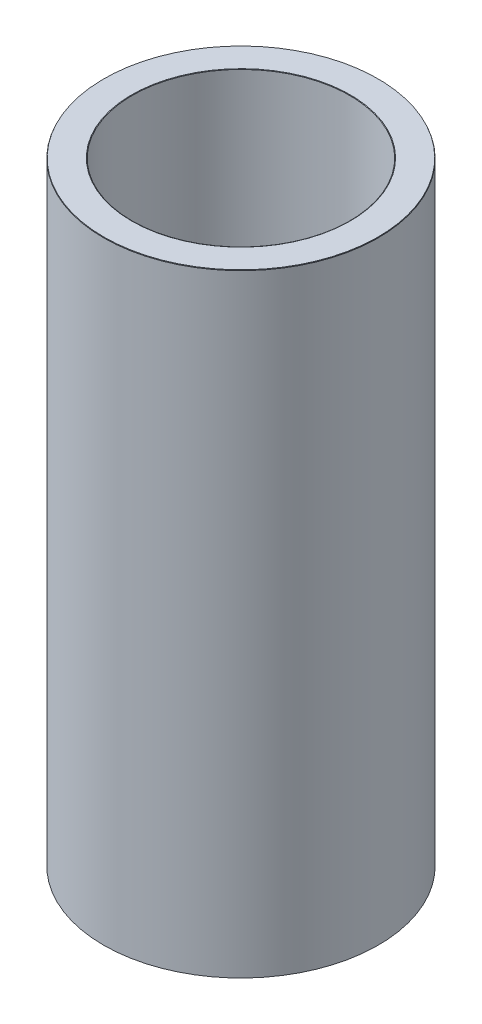
ISO-10303-21;
HEADER;
FILE_DESCRIPTION(('STEP AP214'),'2;1');
FILE_NAME('part.step','',(''),(''),'','','');
FILE_SCHEMA(('AUTOMOTIVE_DESIGN { 1 0 10303 214 1 1 1 1 }'));
ENDSEC;
DATA;
#1=APPLICATION_CONTEXT('core data for automotive mechanical design processes');
#2=APPLICATION_PROTOCOL_DEFINITION('international standard','automotive_design',2000,#1);
#3=PRODUCT_CONTEXT('',#1,'mechanical');
#4=PRODUCT('Part','Part','',(#3));
#5=PRODUCT_RELATED_PRODUCT_CATEGORY('part','',(#4));
#6=PRODUCT_DEFINITION_FORMATION('','',#4);
#7=PRODUCT_DEFINITION_CONTEXT('part definition',#1,'design');
#8=PRODUCT_DEFINITION('design','',#6,#7);
#9=PRODUCT_DEFINITION_SHAPE('','',#8);
#10=(LENGTH_UNIT() NAMED_UNIT(*) SI_UNIT(.MILLI.,.METRE.));
#11=(NAMED_UNIT(*) PLANE_ANGLE_UNIT() SI_UNIT($,.RADIAN.));
#12=(NAMED_UNIT(*) SI_UNIT($,.STERADIAN.) SOLID_ANGLE_UNIT());
#13=UNCERTAINTY_MEASURE_WITH_UNIT(LENGTH_MEASURE(1.E-05),#10,'distance_accuracy_value','');
#14=(GEOMETRIC_REPRESENTATION_CONTEXT(3) GLOBAL_UNCERTAINTY_ASSIGNED_CONTEXT((#13)) GLOBAL_UNIT_ASSIGNED_CONTEXT((#10,
#11,#12)) REPRESENTATION_CONTEXT('',''));
#15=CARTESIAN_POINT('',(0.,0.,0.));
#16=DIRECTION('',(0.,0.,1.));
#17=DIRECTION('',(1.,0.,0.));
#18=AXIS2_PLACEMENT_3D('',#15,#16,#17);
#19=CARTESIAN_POINT('',(0.,256.852065350576,0.));
#20=DIRECTION('',(0.,-1.,0.));
#21=DIRECTION('',(0.,0.,-1.));
#22=AXIS2_PLACEMENT_3D('',#19,#20,#21);
#23=CYLINDRICAL_SURFACE('',#22,57.5);
#24=CARTESIAN_POINT('',(0.,0.111467159006895,0.));
#25=DIRECTION('',(0.,1.,0.));
#26=DIRECTION('',(0.,0.,1.));
#27=AXIS2_PLACEMENT_3D('',#24,#25,#26);
#28=CIRCLE('',#27,57.5);
#29=CARTESIAN_POINT('',(0.,0.111467159006895,57.5));
#30=VERTEX_POINT('',#29);
#31=EDGE_CURVE('E10',#30,#30,#28,.T.);
#32=ORIENTED_EDGE('',*,*,#31,.T.);
#33=EDGE_LOOP('',(#32));
#34=FACE_BOUND('',#33,.T.);
#35=CARTESIAN_POINT('',(0.,256.606469364082,0.));
#36=DIRECTION('',(0.,1.,0.));
#37=DIRECTION('',(0.,0.,1.));
#38=AXIS2_PLACEMENT_3D('',#35,#36,#37);
#39=CIRCLE('',#38,57.5);
#40=CARTESIAN_POINT('',(0.,256.606469364082,57.5));
#41=VERTEX_POINT('',#40);
#42=EDGE_CURVE('E50',#41,#41,#39,.F.);
#43=ORIENTED_EDGE('',*,*,#42,.T.);
#44=EDGE_LOOP('',(#43));
#45=FACE_BOUND('',#44,.T.);
#46=ADVANCED_FACE('F39',(#34,#45),#23,.T.);
#47=CARTESIAN_POINT('',(0.,256.852065350576,0.));
#48=DIRECTION('',(0.,1.,0.));
#49=DIRECTION('',(0.,0.,1.));
#50=AXIS2_PLACEMENT_3D('',#47,#48,#49);
#51=PLANE('',#50);
#52=CARTESIAN_POINT('',(0.,256.852065350576,0.));
#53=DIRECTION('',(0.,1.,0.));
#54=DIRECTION('',(0.,0.,1.));
#55=AXIS2_PLACEMENT_3D('',#52,#53,#54);
#56=CIRCLE('',#55,45.7799379717127);
#57=CARTESIAN_POINT('',(0.,256.852065350576,45.7799379717127));
#58=VERTEX_POINT('',#57);
#59=EDGE_CURVE('E58',#58,#58,#56,.F.);
#60=ORIENTED_EDGE('',*,*,#59,.T.);
#61=EDGE_LOOP('',(#60));
#62=FACE_BOUND('',#61,.T.);
#63=CARTESIAN_POINT('',(0.,256.852065350576,0.));
#64=DIRECTION('',(0.,1.,0.));
#65=DIRECTION('',(0.,0.,1.));
#66=AXIS2_PLACEMENT_3D('',#63,#64,#65);
#67=CIRCLE('',#66,57.3885328409931);
#68=CARTESIAN_POINT('',(0.,256.852065350576,57.3885328409931));
#69=VERTEX_POINT('',#68);
#70=EDGE_CURVE('E61',#69,#69,#67,.T.);
#71=ORIENTED_EDGE('',*,*,#70,.T.);
#72=EDGE_LOOP('',(#71));
#73=FACE_BOUND('',#72,.T.);
#74=ADVANCED_FACE('F88',(#62,#73),#51,.T.);
#75=CARTESIAN_POINT('',(0.,0.,0.));
#76=DIRECTION('',(0.,1.,0.));
#77=DIRECTION('',(0.,0.,1.));
#78=AXIS2_PLACEMENT_3D('',#75,#76,#77);
#79=PLANE('',#78);
#80=CARTESIAN_POINT('',(0.,0.,0.));
#81=DIRECTION('',(0.,1.,0.));
#82=DIRECTION('',(0.,0.,1.));
#83=AXIS2_PLACEMENT_3D('',#80,#81,#82);
#84=CIRCLE('',#83,45.6458091442249);
#85=CARTESIAN_POINT('',(0.,0.,45.6458091442249));
#86=VERTEX_POINT('',#85);
#87=EDGE_CURVE('E51',#86,#86,#84,.T.);
#88=ORIENTED_EDGE('',*,*,#87,.T.);
#89=EDGE_LOOP('',(#88));
#90=FACE_BOUND('',#89,.T.);
#91=CARTESIAN_POINT('',(0.,0.,0.));
#92=DIRECTION('',(0.,1.,0.));
#93=DIRECTION('',(0.,0.,1.));
#94=AXIS2_PLACEMENT_3D('',#91,#92,#93);
#95=CIRCLE('',#94,57.2544040135053);
#96=CARTESIAN_POINT('',(0.,0.,57.2544040135053));
#97=VERTEX_POINT('',#96);
#98=EDGE_CURVE('E54',#97,#97,#95,.F.);
#99=ORIENTED_EDGE('',*,*,#98,.T.);
#100=EDGE_LOOP('',(#99));
#101=FACE_BOUND('',#100,.T.);
#102=ADVANCED_FACE('F83',(#90,#101),#79,.F.);
#103=CARTESIAN_POINT('',(0.,256.852065350576,0.));
#104=DIRECTION('',(0.,-1.,0.));
#105=DIRECTION('',(0.,0.,-1.));
#106=AXIS2_PLACEMENT_3D('',#103,#104,#105);
#107=CYLINDRICAL_SURFACE('',#106,45.534341985218);
#108=CARTESIAN_POINT('',(0.,256.740598191569,0.));
#109=DIRECTION('',(0.,1.,0.));
#110=DIRECTION('',(0.,0.,1.));
#111=AXIS2_PLACEMENT_3D('',#108,#109,#110);
#112=CIRCLE('',#111,45.534341985218);
#113=CARTESIAN_POINT('',(0.,256.740598191569,45.534341985218));
#114=VERTEX_POINT('',#113);
#115=EDGE_CURVE('E67',#114,#114,#112,.T.);
#116=ORIENTED_EDGE('',*,*,#115,.T.);
#117=EDGE_LOOP('',(#116));
#118=FACE_BOUND('',#117,.T.);
#119=CARTESIAN_POINT('',(0.,0.245595986494707,0.));
#120=DIRECTION('',(0.,1.,0.));
#121=DIRECTION('',(0.,0.,1.));
#122=AXIS2_PLACEMENT_3D('',#119,#120,#121);
#123=CIRCLE('',#122,45.534341985218);
#124=CARTESIAN_POINT('',(0.,0.245595986494707,45.534341985218));
#125=VERTEX_POINT('',#124);
#126=EDGE_CURVE('E69',#125,#125,#123,.F.);
#127=ORIENTED_EDGE('',*,*,#126,.T.);
#128=EDGE_LOOP('',(#127));
#129=FACE_BOUND('',#128,.T.);
#130=ADVANCED_FACE('F71',(#118,#129),#107,.F.);
#131=CARTESIAN_POINT('',(0.,256.740598191569,0.));
#132=DIRECTION('',(0.,1.,0.));
#133=DIRECTION('',(0.,0.,1.));
#134=AXIS2_PLACEMENT_3D('',#131,#132,#133);
#135=CONICAL_SURFACE('',#134,45.534341985218,1.14473380587368);
#136=ORIENTED_EDGE('',*,*,#59,.F.);
#137=EDGE_LOOP('',(#136));
#138=FACE_BOUND('',#137,.T.);
#139=ORIENTED_EDGE('',*,*,#115,.F.);
#140=EDGE_LOOP('',(#139));
#141=FACE_BOUND('',#140,.T.);
#142=ADVANCED_FACE('F77',(#138,#141),#135,.F.);
#143=CARTESIAN_POINT('',(0.,0.,0.));
#144=DIRECTION('',(0.,-1.,0.));
#145=DIRECTION('',(0.,0.,-1.));
#146=AXIS2_PLACEMENT_3D('',#143,#144,#145);
#147=CONICAL_SURFACE('',#146,45.6458091442249,0.426062520921132);
#148=ORIENTED_EDGE('',*,*,#126,.F.);
#149=EDGE_LOOP('',(#148));
#150=FACE_BOUND('',#149,.T.);
#151=ORIENTED_EDGE('',*,*,#87,.F.);
#152=EDGE_LOOP('',(#151));
#153=FACE_BOUND('',#152,.T.);
#154=ADVANCED_FACE('F73',(#150,#153),#147,.F.);
#155=CARTESIAN_POINT('',(0.,0.111467159006895,0.));
#156=DIRECTION('',(0.,1.,0.));
#157=DIRECTION('',(0.,0.,1.));
#158=AXIS2_PLACEMENT_3D('',#155,#156,#157);
#159=CONICAL_SURFACE('',#158,57.5,1.14473380587372);
#160=ORIENTED_EDGE('',*,*,#98,.F.);
#161=EDGE_LOOP('',(#160));
#162=FACE_BOUND('',#161,.T.);
#163=ORIENTED_EDGE('',*,*,#31,.F.);
#164=EDGE_LOOP('',(#163));
#165=FACE_BOUND('',#164,.T.);
#166=ADVANCED_FACE('F76',(#162,#165),#159,.T.);
#167=CARTESIAN_POINT('',(0.,256.852065350576,0.));
#168=DIRECTION('',(0.,-1.,0.));
#169=DIRECTION('',(0.,0.,-1.));
#170=AXIS2_PLACEMENT_3D('',#167,#168,#169);
#171=CONICAL_SURFACE('',#170,57.3885328409931,0.42606252092107);
#172=ORIENTED_EDGE('',*,*,#42,.F.);
#173=EDGE_LOOP('',(#172));
#174=FACE_BOUND('',#173,.T.);
#175=ORIENTED_EDGE('',*,*,#70,.F.);
#176=EDGE_LOOP('',(#175));
#177=FACE_BOUND('',#176,.T.);
#178=ADVANCED_FACE('F45',(#174,#177),#171,.T.);
#179=CLOSED_SHELL('',(#46,#74,#102,#130,#142,#154,#166,#178));
#180=MANIFOLD_SOLID_BREP('B2',#179);
#181=ADVANCED_BREP_SHAPE_REPRESENTATION('',(#18,#180),#14);
#182=SHAPE_DEFINITION_REPRESENTATION(#9,#181);
ENDSEC;
END-ISO-10303-21;
